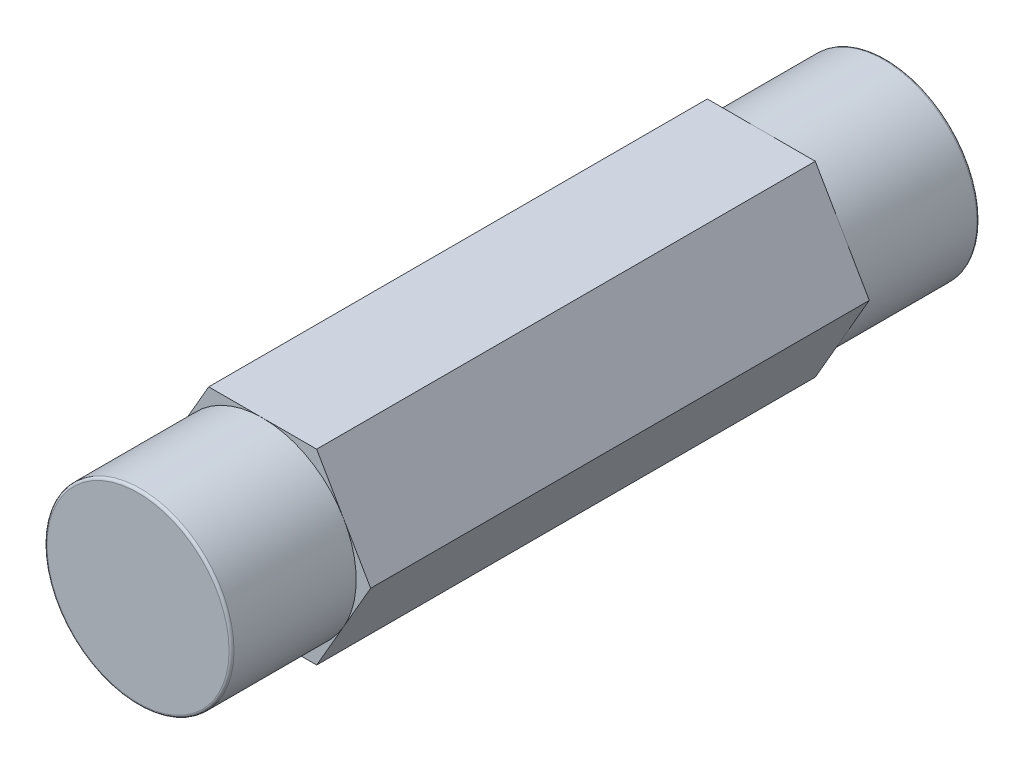
ISO-10303-21;
HEADER;
FILE_DESCRIPTION(('STEP AP214'),'2;1');
FILE_NAME('part.step','',(''),(''),'','','');
FILE_SCHEMA(('AUTOMOTIVE_DESIGN { 1 0 10303 214 1 1 1 1 }'));
ENDSEC;
DATA;
#1=APPLICATION_CONTEXT('core data for automotive mechanical design processes');
#2=APPLICATION_PROTOCOL_DEFINITION('international standard','automotive_design',2000,#1);
#3=PRODUCT_CONTEXT('',#1,'mechanical');
#4=PRODUCT('Part','Part','',(#3));
#5=PRODUCT_RELATED_PRODUCT_CATEGORY('part','',(#4));
#6=PRODUCT_DEFINITION_FORMATION('','',#4);
#7=PRODUCT_DEFINITION_CONTEXT('part definition',#1,'design');
#8=PRODUCT_DEFINITION('design','',#6,#7);
#9=PRODUCT_DEFINITION_SHAPE('','',#8);
#10=(LENGTH_UNIT() NAMED_UNIT(*) SI_UNIT(.MILLI.,.METRE.));
#11=(NAMED_UNIT(*) PLANE_ANGLE_UNIT() SI_UNIT($,.RADIAN.));
#12=(NAMED_UNIT(*) SI_UNIT($,.STERADIAN.) SOLID_ANGLE_UNIT());
#13=UNCERTAINTY_MEASURE_WITH_UNIT(LENGTH_MEASURE(1.E-05),#10,'distance_accuracy_value','');
#14=(GEOMETRIC_REPRESENTATION_CONTEXT(3) GLOBAL_UNCERTAINTY_ASSIGNED_CONTEXT((#13)) GLOBAL_UNIT_ASSIGNED_CONTEXT((#10,
#11,#12)) REPRESENTATION_CONTEXT('',''));
#15=CARTESIAN_POINT('',(0.,0.,0.));
#16=DIRECTION('',(0.,0.,1.));
#17=DIRECTION('',(1.,0.,0.));
#18=AXIS2_PLACEMENT_3D('',#15,#16,#17);
#19=CARTESIAN_POINT('',(5.49926131403119,0.,38.1));
#20=DIRECTION('',(0.,0.,1.));
#21=DIRECTION('',(1.,0.,0.));
#22=AXIS2_PLACEMENT_3D('',#19,#20,#21);
#23=PLANE('',#22);
#24=CARTESIAN_POINT('',(0.,0.,38.1));
#25=DIRECTION('',(0.,0.,-1.));
#26=DIRECTION('',(-1.,0.,0.));
#27=AXIS2_PLACEMENT_3D('',#24,#25,#26);
#28=CIRCLE('',#27,4.6355);
#29=CARTESIAN_POINT('',(-4.6355,0.,38.1));
#30=VERTEX_POINT('',#29);
#31=CARTESIAN_POINT('',(4.6355,0.,38.1));
#32=VERTEX_POINT('',#31);
#33=EDGE_CURVE('E239',#30,#32,#28,.T.);
#34=ORIENTED_EDGE('',*,*,#33,.F.);
#35=CARTESIAN_POINT('',(0.,0.,38.1));
#36=DIRECTION('',(0.,0.,-1.));
#37=DIRECTION('',(1.,0.,0.));
#38=AXIS2_PLACEMENT_3D('',#35,#36,#37);
#39=CIRCLE('',#38,4.6355);
#40=EDGE_CURVE('E242',#32,#30,#39,.T.);
#41=ORIENTED_EDGE('',*,*,#40,.F.);
#42=EDGE_LOOP('',(#34,#41));
#43=FACE_BOUND('',#42,.T.);
#44=ADVANCED_FACE('F17',(#43),#23,.T.);
#45=CARTESIAN_POINT('',(5.49926131403119,0.,0.));
#46=DIRECTION('',(0.,0.,1.));
#47=DIRECTION('',(1.,0.,0.));
#48=AXIS2_PLACEMENT_3D('',#45,#46,#47);
#49=PLANE('',#48);
#50=CARTESIAN_POINT('',(0.,0.,0.));
#51=DIRECTION('',(0.,0.,1.));
#52=DIRECTION('',(1.,0.,0.));
#53=AXIS2_PLACEMENT_3D('',#50,#51,#52);
#54=CIRCLE('',#53,4.6355);
#55=CARTESIAN_POINT('',(4.6355,0.,0.));
#56=VERTEX_POINT('',#55);
#57=CARTESIAN_POINT('',(-4.6355,0.,0.));
#58=VERTEX_POINT('',#57);
#59=EDGE_CURVE('E199',#56,#58,#54,.T.);
#60=ORIENTED_EDGE('',*,*,#59,.F.);
#61=CARTESIAN_POINT('',(0.,0.,0.));
#62=DIRECTION('',(0.,0.,1.));
#63=DIRECTION('',(-1.,0.,0.));
#64=AXIS2_PLACEMENT_3D('',#61,#62,#63);
#65=CIRCLE('',#64,4.6355);
#66=EDGE_CURVE('E296',#58,#56,#65,.T.);
#67=ORIENTED_EDGE('',*,*,#66,.F.);
#68=EDGE_LOOP('',(#60,#67));
#69=FACE_BOUND('',#68,.T.);
#70=ADVANCED_FACE('F307',(#69),#49,.F.);
#71=CARTESIAN_POINT('',(0.,0.,31.75));
#72=DIRECTION('',(0.,0.,1.));
#73=DIRECTION('',(1.,0.,0.));
#74=AXIS2_PLACEMENT_3D('',#71,#72,#73);
#75=PLANE('',#74);
#76=CARTESIAN_POINT('',(0.,0.,31.75));
#77=DIRECTION('',(0.,0.,1.));
#78=DIRECTION('',(1.,0.,0.));
#79=AXIS2_PLACEMENT_3D('',#76,#77,#78);
#80=CIRCLE('',#79,4.7625);
#81=CARTESIAN_POINT('',(-4.1244459855234,2.38125,31.75));
#82=VERTEX_POINT('',#81);
#83=CARTESIAN_POINT('',(-4.1244459855234,-2.38124999999999,31.75));
#84=VERTEX_POINT('',#83);
#85=EDGE_CURVE('E127',#82,#84,#80,.T.);
#86=ORIENTED_EDGE('',*,*,#85,.F.);
#87=DIRECTION('',(0.5,0.866025403784439,0.));
#88=VECTOR('',#87,1.);
#89=CARTESIAN_POINT('',(-2.7496306570156,4.76250000000001,31.75));
#90=LINE('',#89,#88);
#91=CARTESIAN_POINT('',(-5.4992613140312,0.,31.75));
#92=VERTEX_POINT('',#91);
#93=EDGE_CURVE('E294',#82,#92,#90,.F.);
#94=ORIENTED_EDGE('',*,*,#93,.T.);
#95=DIRECTION('',(-0.5,0.866025403784439,0.));
#96=VECTOR('',#95,1.);
#97=CARTESIAN_POINT('',(-5.4992613140312,0.,31.75));
#98=LINE('',#97,#96);
#99=EDGE_CURVE('E189',#92,#84,#98,.F.);
#100=ORIENTED_EDGE('',*,*,#99,.T.);
#101=EDGE_LOOP('',(#86,#94,#100));
#102=FACE_BOUND('',#101,.T.);
#103=ADVANCED_FACE('F272',(#102),#75,.T.);
#104=CARTESIAN_POINT('',(0.,0.,37.973));
#105=DIRECTION('',(0.,0.,1.));
#106=DIRECTION('',(1.,0.,0.));
#107=AXIS2_PLACEMENT_3D('',#104,#105,#106);
#108=TOROIDAL_SURFACE('',#107,4.6355,0.127);
#109=CARTESIAN_POINT('',(0.,0.,37.973));
#110=DIRECTION('',(0.,0.,1.));
#111=DIRECTION('',(1.,0.,0.));
#112=AXIS2_PLACEMENT_3D('',#109,#110,#111);
#113=CIRCLE('',#112,4.7625);
#114=CARTESIAN_POINT('',(4.7625,0.,37.973));
#115=VERTEX_POINT('',#114);
#116=EDGE_CURVE('E141',#115,#115,#113,.F.);
#117=ORIENTED_EDGE('',*,*,#116,.F.);
#118=EDGE_LOOP('',(#117));
#119=FACE_BOUND('',#118,.T.);
#120=ORIENTED_EDGE('',*,*,#40,.T.);
#121=ORIENTED_EDGE('',*,*,#33,.T.);
#122=EDGE_LOOP('',(#120,#121));
#123=FACE_BOUND('',#122,.T.);
#124=ADVANCED_FACE('F241',(#119,#123),#108,.T.);
#125=CARTESIAN_POINT('',(0.,0.,31.75));
#126=DIRECTION('',(0.,0.,1.));
#127=DIRECTION('',(1.,0.,0.));
#128=AXIS2_PLACEMENT_3D('',#125,#126,#127);
#129=PLANE('',#128);
#130=DIRECTION('',(0.5,0.866025403784439,0.));
#131=VECTOR('',#130,1.);
#132=CARTESIAN_POINT('',(-2.7496306570156,4.76250000000001,31.75));
#133=LINE('',#132,#131);
#134=CARTESIAN_POINT('',(-2.7496306570156,4.76250000000001,31.75));
#135=VERTEX_POINT('',#134);
#136=EDGE_CURVE('E124',#135,#82,#133,.F.);
#137=ORIENTED_EDGE('',*,*,#136,.T.);
#138=CARTESIAN_POINT('',(0.,0.,31.75));
#139=DIRECTION('',(0.,0.,1.));
#140=DIRECTION('',(1.,0.,0.));
#141=AXIS2_PLACEMENT_3D('',#138,#139,#140);
#142=CIRCLE('',#141,4.7625);
#143=CARTESIAN_POINT('',(0.,4.76250000000001,31.75));
#144=VERTEX_POINT('',#143);
#145=EDGE_CURVE('E119',#144,#82,#142,.T.);
#146=ORIENTED_EDGE('',*,*,#145,.F.);
#147=DIRECTION('',(1.,0.,0.));
#148=VECTOR('',#147,1.);
#149=CARTESIAN_POINT('',(2.74963065701559,4.76250000000001,31.75));
#150=LINE('',#149,#148);
#151=EDGE_CURVE('E123',#144,#135,#150,.F.);
#152=ORIENTED_EDGE('',*,*,#151,.T.);
#153=EDGE_LOOP('',(#137,#146,#152));
#154=FACE_BOUND('',#153,.T.);
#155=ADVANCED_FACE('F121',(#154),#129,.T.);
#156=CARTESIAN_POINT('',(-2.7496306570156,4.76250000000001,38.1));
#157=DIRECTION('',(0.866025403784439,-0.5,0.));
#158=DIRECTION('',(0.5,0.866025403784439,0.));
#159=AXIS2_PLACEMENT_3D('',#156,#157,#158);
#160=PLANE('',#159);
#161=DIRECTION('',(0.,0.,1.));
#162=VECTOR('',#161,1.);
#163=CARTESIAN_POINT('',(-5.4992613140312,0.,38.1));
#164=LINE('',#163,#162);
#165=CARTESIAN_POINT('',(-5.4992613140312,0.,6.34999999999999));
#166=VERTEX_POINT('',#165);
#167=EDGE_CURVE('E283',#166,#92,#164,.T.);
#168=ORIENTED_EDGE('',*,*,#167,.T.);
#169=ORIENTED_EDGE('',*,*,#93,.F.);
#170=ORIENTED_EDGE('',*,*,#136,.F.);
#171=DIRECTION('',(0.,0.,-1.));
#172=VECTOR('',#171,1.);
#173=CARTESIAN_POINT('',(-2.7496306570156,4.76250000000001,38.1));
#174=LINE('',#173,#172);
#175=CARTESIAN_POINT('',(-2.7496306570156,4.76250000000001,6.35));
#176=VERTEX_POINT('',#175);
#177=EDGE_CURVE('E150',#135,#176,#174,.T.);
#178=ORIENTED_EDGE('',*,*,#177,.T.);
#179=DIRECTION('',(0.499999999999997,0.866025403784441,0.));
#180=VECTOR('',#179,1.);
#181=CARTESIAN_POINT('',(-4.12444598552339,2.38125,6.35));
#182=LINE('',#181,#180);
#183=CARTESIAN_POINT('',(-4.12444598552339,2.38125,6.35));
#184=VERTEX_POINT('',#183);
#185=EDGE_CURVE('E192',#184,#176,#182,.T.);
#186=ORIENTED_EDGE('',*,*,#185,.F.);
#187=DIRECTION('',(0.500000000000003,0.866025403784437,0.));
#188=VECTOR('',#187,1.);
#189=CARTESIAN_POINT('',(-5.4992613140312,0.,6.35));
#190=LINE('',#189,#188);
#191=EDGE_CURVE('E195',#166,#184,#190,.T.);
#192=ORIENTED_EDGE('',*,*,#191,.F.);
#193=EDGE_LOOP('',(#168,#169,#170,#178,#186,#192));
#194=FACE_BOUND('',#193,.T.);
#195=ADVANCED_FACE('F218',(#194),#160,.F.);
#196=CARTESIAN_POINT('',(0.,0.,0.127));
#197=DIRECTION('',(0.,0.,1.));
#198=DIRECTION('',(1.,0.,0.));
#199=AXIS2_PLACEMENT_3D('',#196,#197,#198);
#200=TOROIDAL_SURFACE('',#199,4.6355,0.127);
#201=CARTESIAN_POINT('',(0.,0.,0.127));
#202=DIRECTION('',(0.,0.,-1.));
#203=DIRECTION('',(-1.,0.,0.));
#204=AXIS2_PLACEMENT_3D('',#201,#202,#203);
#205=CIRCLE('',#204,4.7625);
#206=CARTESIAN_POINT('',(-4.7625,0.,0.127));
#207=VERTEX_POINT('',#206);
#208=EDGE_CURVE('E202',#207,#207,#205,.F.);
#209=ORIENTED_EDGE('',*,*,#208,.F.);
#210=EDGE_LOOP('',(#209));
#211=FACE_BOUND('',#210,.T.);
#212=ORIENTED_EDGE('',*,*,#59,.T.);
#213=ORIENTED_EDGE('',*,*,#66,.T.);
#214=EDGE_LOOP('',(#212,#213));
#215=FACE_BOUND('',#214,.T.);
#216=ADVANCED_FACE('F212',(#211,#215),#200,.T.);
#217=CARTESIAN_POINT('',(0.,0.,6.35));
#218=DIRECTION('',(0.,0.,-1.));
#219=DIRECTION('',(-1.,0.,0.));
#220=AXIS2_PLACEMENT_3D('',#217,#218,#219);
#221=PLANE('',#220);
#222=CARTESIAN_POINT('',(0.,0.,6.35));
#223=DIRECTION('',(0.,0.,-1.));
#224=DIRECTION('',(-1.,0.,0.));
#225=AXIS2_PLACEMENT_3D('',#222,#223,#224);
#226=CIRCLE('',#225,4.7625);
#227=CARTESIAN_POINT('',(-4.1244459855234,-2.38125,6.34999999999999));
#228=VERTEX_POINT('',#227);
#229=EDGE_CURVE('E205',#228,#184,#226,.T.);
#230=ORIENTED_EDGE('',*,*,#229,.F.);
#231=DIRECTION('',(-0.5,0.866025403784439,0.));
#232=VECTOR('',#231,1.);
#233=CARTESIAN_POINT('',(-5.4992613140312,0.,6.34999999999999));
#234=LINE('',#233,#232);
#235=EDGE_CURVE('E194',#228,#166,#234,.T.);
#236=ORIENTED_EDGE('',*,*,#235,.T.);
#237=ORIENTED_EDGE('',*,*,#191,.T.);
#238=EDGE_LOOP('',(#230,#236,#237));
#239=FACE_BOUND('',#238,.T.);
#240=ADVANCED_FACE('F217',(#239),#221,.T.);
#241=CARTESIAN_POINT('',(0.,0.,6.35));
#242=DIRECTION('',(0.,0.,-1.));
#243=DIRECTION('',(-1.,0.,0.));
#244=AXIS2_PLACEMENT_3D('',#241,#242,#243);
#245=PLANE('',#244);
#246=CARTESIAN_POINT('',(0.,0.,6.35));
#247=DIRECTION('',(0.,0.,-1.));
#248=DIRECTION('',(-1.,0.,0.));
#249=AXIS2_PLACEMENT_3D('',#246,#247,#248);
#250=CIRCLE('',#249,4.7625);
#251=CARTESIAN_POINT('',(0.,4.76250000000001,6.35));
#252=VERTEX_POINT('',#251);
#253=EDGE_CURVE('E395',#184,#252,#250,.T.);
#254=ORIENTED_EDGE('',*,*,#253,.F.);
#255=ORIENTED_EDGE('',*,*,#185,.T.);
#256=DIRECTION('',(1.,0.,0.));
#257=VECTOR('',#256,1.);
#258=CARTESIAN_POINT('',(2.74963065701559,4.76250000000001,6.35));
#259=LINE('',#258,#257);
#260=EDGE_CURVE('E209',#176,#252,#259,.T.);
#261=ORIENTED_EDGE('',*,*,#260,.T.);
#262=EDGE_LOOP('',(#254,#255,#261));
#263=FACE_BOUND('',#262,.T.);
#264=ADVANCED_FACE('F385',(#263),#245,.T.);
#265=CARTESIAN_POINT('',(0.,0.,6.35));
#266=DIRECTION('',(0.,0.,-1.));
#267=DIRECTION('',(-1.,0.,0.));
#268=AXIS2_PLACEMENT_3D('',#265,#266,#267);
#269=PLANE('',#268);
#270=CARTESIAN_POINT('',(0.,0.,6.35));
#271=DIRECTION('',(0.,0.,-1.));
#272=DIRECTION('',(-1.,0.,0.));
#273=AXIS2_PLACEMENT_3D('',#270,#271,#272);
#274=CIRCLE('',#273,4.7625);
#275=CARTESIAN_POINT('',(0.,-4.76250000000001,6.35));
#276=VERTEX_POINT('',#275);
#277=EDGE_CURVE('E206',#276,#228,#274,.T.);
#278=ORIENTED_EDGE('',*,*,#277,.F.);
#279=DIRECTION('',(1.,0.,0.));
#280=VECTOR('',#279,1.);
#281=CARTESIAN_POINT('',(-2.7496306570156,-4.76250000000001,6.35));
#282=LINE('',#281,#280);
#283=CARTESIAN_POINT('',(-2.7496306570156,-4.76250000000001,6.35));
#284=VERTEX_POINT('',#283);
#285=EDGE_CURVE('E173',#276,#284,#282,.F.);
#286=ORIENTED_EDGE('',*,*,#285,.T.);
#287=DIRECTION('',(-0.5,0.866025403784439,0.));
#288=VECTOR('',#287,1.);
#289=CARTESIAN_POINT('',(-5.4992613140312,0.,6.34999999999999));
#290=LINE('',#289,#288);
#291=EDGE_CURVE('E180',#284,#228,#290,.T.);
#292=ORIENTED_EDGE('',*,*,#291,.T.);
#293=EDGE_LOOP('',(#278,#286,#292));
#294=FACE_BOUND('',#293,.T.);
#295=ADVANCED_FACE('F382',(#294),#269,.T.);
#296=CARTESIAN_POINT('',(-5.4992613140312,0.,38.1));
#297=DIRECTION('',(0.866025403784439,0.5,0.));
#298=DIRECTION('',(-0.5,0.866025403784439,0.));
#299=AXIS2_PLACEMENT_3D('',#296,#297,#298);
#300=PLANE('',#299);
#301=DIRECTION('',(0.,0.,1.));
#302=VECTOR('',#301,1.);
#303=CARTESIAN_POINT('',(-2.7496306570156,-4.76250000000001,38.1));
#304=LINE('',#303,#302);
#305=CARTESIAN_POINT('',(-2.7496306570156,-4.76250000000001,31.75));
#306=VERTEX_POINT('',#305);
#307=EDGE_CURVE('E170',#284,#306,#304,.T.);
#308=ORIENTED_EDGE('',*,*,#307,.T.);
#309=DIRECTION('',(0.499999999999997,-0.866025403784441,0.));
#310=VECTOR('',#309,1.);
#311=CARTESIAN_POINT('',(-4.12444598552339,-2.38125,31.75));
#312=LINE('',#311,#310);
#313=EDGE_CURVE('E128',#84,#306,#312,.T.);
#314=ORIENTED_EDGE('',*,*,#313,.F.);
#315=ORIENTED_EDGE('',*,*,#99,.F.);
#316=ORIENTED_EDGE('',*,*,#167,.F.);
#317=ORIENTED_EDGE('',*,*,#235,.F.);
#318=ORIENTED_EDGE('',*,*,#291,.F.);
#319=EDGE_LOOP('',(#308,#314,#315,#316,#317,#318));
#320=FACE_BOUND('',#319,.T.);
#321=ADVANCED_FACE('F378',(#320),#300,.F.);
#322=CARTESIAN_POINT('',(0.,0.,31.75));
#323=DIRECTION('',(0.,0.,1.));
#324=DIRECTION('',(1.,0.,0.));
#325=AXIS2_PLACEMENT_3D('',#322,#323,#324);
#326=PLANE('',#325);
#327=DIRECTION('',(1.,0.,0.));
#328=VECTOR('',#327,1.);
#329=CARTESIAN_POINT('',(-2.7496306570156,-4.76250000000001,31.75));
#330=LINE('',#329,#328);
#331=CARTESIAN_POINT('',(0.,-4.76250000000001,31.75));
#332=VERTEX_POINT('',#331);
#333=EDGE_CURVE('E166',#306,#332,#330,.T.);
#334=ORIENTED_EDGE('',*,*,#333,.T.);
#335=CARTESIAN_POINT('',(0.,0.,31.75));
#336=DIRECTION('',(0.,0.,1.));
#337=DIRECTION('',(1.,0.,0.));
#338=AXIS2_PLACEMENT_3D('',#335,#336,#337);
#339=CIRCLE('',#338,4.7625);
#340=EDGE_CURVE('E281',#84,#332,#339,.T.);
#341=ORIENTED_EDGE('',*,*,#340,.F.);
#342=ORIENTED_EDGE('',*,*,#313,.T.);
#343=EDGE_LOOP('',(#334,#341,#342));
#344=FACE_BOUND('',#343,.T.);
#345=ADVANCED_FACE('F375',(#344),#326,.T.);
#346=CARTESIAN_POINT('',(0.,0.,31.75));
#347=DIRECTION('',(0.,0.,1.));
#348=DIRECTION('',(1.,0.,0.));
#349=AXIS2_PLACEMENT_3D('',#346,#347,#348);
#350=CYLINDRICAL_SURFACE('',#349,4.7625);
#351=ORIENTED_EDGE('',*,*,#145,.T.);
#352=ORIENTED_EDGE('',*,*,#85,.T.);
#353=ORIENTED_EDGE('',*,*,#340,.T.);
#354=CARTESIAN_POINT('',(0.,0.,31.75));
#355=DIRECTION('',(0.,0.,1.));
#356=DIRECTION('',(1.,0.,0.));
#357=AXIS2_PLACEMENT_3D('',#354,#355,#356);
#358=CIRCLE('',#357,4.7625);
#359=CARTESIAN_POINT('',(4.12444598552339,-2.38125,31.75));
#360=VERTEX_POINT('',#359);
#361=EDGE_CURVE('E426',#360,#332,#358,.F.);
#362=ORIENTED_EDGE('',*,*,#361,.F.);
#363=CARTESIAN_POINT('',(0.,0.,31.75));
#364=DIRECTION('',(0.,0.,1.));
#365=DIRECTION('',(1.,0.,0.));
#366=AXIS2_PLACEMENT_3D('',#363,#364,#365);
#367=CIRCLE('',#366,4.7625);
#368=CARTESIAN_POINT('',(4.12444598552339,2.38125,31.75));
#369=VERTEX_POINT('',#368);
#370=EDGE_CURVE('E135',#369,#360,#367,.F.);
#371=ORIENTED_EDGE('',*,*,#370,.F.);
#372=CARTESIAN_POINT('',(0.,0.,31.75));
#373=DIRECTION('',(0.,0.,1.));
#374=DIRECTION('',(1.,0.,0.));
#375=AXIS2_PLACEMENT_3D('',#372,#373,#374);
#376=CIRCLE('',#375,4.7625);
#377=EDGE_CURVE('E131',#144,#369,#376,.F.);
#378=ORIENTED_EDGE('',*,*,#377,.F.);
#379=EDGE_LOOP('',(#351,#352,#353,#362,#371,#378));
#380=FACE_BOUND('',#379,.T.);
#381=ORIENTED_EDGE('',*,*,#116,.T.);
#382=EDGE_LOOP('',(#381));
#383=FACE_BOUND('',#382,.T.);
#384=ADVANCED_FACE('F132',(#380,#383),#350,.T.);
#385=CARTESIAN_POINT('',(0.,0.,31.75));
#386=DIRECTION('',(0.,0.,1.));
#387=DIRECTION('',(1.,0.,0.));
#388=AXIS2_PLACEMENT_3D('',#385,#386,#387);
#389=PLANE('',#388);
#390=DIRECTION('',(1.,0.,0.));
#391=VECTOR('',#390,1.);
#392=CARTESIAN_POINT('',(2.74963065701559,4.76250000000001,31.75));
#393=LINE('',#392,#391);
#394=CARTESIAN_POINT('',(2.74963065701559,4.76250000000001,31.75));
#395=VERTEX_POINT('',#394);
#396=EDGE_CURVE('E140',#395,#144,#393,.F.);
#397=ORIENTED_EDGE('',*,*,#396,.T.);
#398=ORIENTED_EDGE('',*,*,#377,.T.);
#399=DIRECTION('',(0.500000000000001,-0.866025403784438,0.));
#400=VECTOR('',#399,1.);
#401=CARTESIAN_POINT('',(5.49926131403119,0.,31.75));
#402=LINE('',#401,#400);
#403=EDGE_CURVE('E153',#369,#395,#402,.F.);
#404=ORIENTED_EDGE('',*,*,#403,.T.);
#405=EDGE_LOOP('',(#397,#398,#404));
#406=FACE_BOUND('',#405,.T.);
#407=ADVANCED_FACE('F152',(#406),#389,.T.);
#408=CARTESIAN_POINT('',(2.74963065701559,4.76250000000001,38.1));
#409=DIRECTION('',(0.,-1.,0.));
#410=DIRECTION('',(0.,0.,-1.));
#411=AXIS2_PLACEMENT_3D('',#408,#409,#410);
#412=PLANE('',#411);
#413=ORIENTED_EDGE('',*,*,#177,.F.);
#414=ORIENTED_EDGE('',*,*,#151,.F.);
#415=ORIENTED_EDGE('',*,*,#396,.F.);
#416=DIRECTION('',(0.,0.,1.));
#417=VECTOR('',#416,1.);
#418=CARTESIAN_POINT('',(2.74963065701559,4.76250000000001,38.1));
#419=LINE('',#418,#417);
#420=CARTESIAN_POINT('',(2.74963065701559,4.76250000000001,6.35));
#421=VERTEX_POINT('',#420);
#422=EDGE_CURVE('E162',#395,#421,#419,.F.);
#423=ORIENTED_EDGE('',*,*,#422,.T.);
#424=DIRECTION('',(-1.,0.,0.));
#425=VECTOR('',#424,1.);
#426=CARTESIAN_POINT('',(0.,4.7625,6.35));
#427=LINE('',#426,#425);
#428=EDGE_CURVE('E407',#252,#421,#427,.F.);
#429=ORIENTED_EDGE('',*,*,#428,.F.);
#430=ORIENTED_EDGE('',*,*,#260,.F.);
#431=EDGE_LOOP('',(#413,#414,#415,#423,#429,#430));
#432=FACE_BOUND('',#431,.T.);
#433=ADVANCED_FACE('F145',(#432),#412,.F.);
#434=CARTESIAN_POINT('',(0.,0.,6.35));
#435=DIRECTION('',(0.,0.,-1.));
#436=DIRECTION('',(-1.,0.,0.));
#437=AXIS2_PLACEMENT_3D('',#434,#435,#436);
#438=PLANE('',#437);
#439=DIRECTION('',(0.500000000000001,-0.866025403784438,0.));
#440=VECTOR('',#439,1.);
#441=CARTESIAN_POINT('',(5.49926131403119,0.,6.35));
#442=LINE('',#441,#440);
#443=CARTESIAN_POINT('',(4.12444598552339,2.38125,6.35));
#444=VERTEX_POINT('',#443);
#445=EDGE_CURVE('E444',#421,#444,#442,.T.);
#446=ORIENTED_EDGE('',*,*,#445,.T.);
#447=CARTESIAN_POINT('',(0.,0.,6.35));
#448=DIRECTION('',(0.,0.,-1.));
#449=DIRECTION('',(-1.,0.,0.));
#450=AXIS2_PLACEMENT_3D('',#447,#448,#449);
#451=CIRCLE('',#450,4.7625);
#452=EDGE_CURVE('E400',#252,#444,#451,.T.);
#453=ORIENTED_EDGE('',*,*,#452,.F.);
#454=ORIENTED_EDGE('',*,*,#428,.T.);
#455=EDGE_LOOP('',(#446,#453,#454));
#456=FACE_BOUND('',#455,.T.);
#457=ADVANCED_FACE('F364',(#456),#438,.T.);
#458=CARTESIAN_POINT('',(0.,0.,6.35));
#459=DIRECTION('',(0.,0.,-1.));
#460=DIRECTION('',(-1.,0.,0.));
#461=AXIS2_PLACEMENT_3D('',#458,#459,#460);
#462=CYLINDRICAL_SURFACE('',#461,4.7625);
#463=ORIENTED_EDGE('',*,*,#208,.T.);
#464=EDGE_LOOP('',(#463));
#465=FACE_BOUND('',#464,.T.);
#466=ORIENTED_EDGE('',*,*,#253,.T.);
#467=ORIENTED_EDGE('',*,*,#452,.T.);
#468=CARTESIAN_POINT('',(0.,0.,6.35));
#469=DIRECTION('',(0.,0.,-1.));
#470=DIRECTION('',(-1.,0.,0.));
#471=AXIS2_PLACEMENT_3D('',#468,#469,#470);
#472=CIRCLE('',#471,4.7625);
#473=CARTESIAN_POINT('',(4.12444598552339,-2.38125,6.35));
#474=VERTEX_POINT('',#473);
#475=EDGE_CURVE('E261',#474,#444,#472,.F.);
#476=ORIENTED_EDGE('',*,*,#475,.F.);
#477=CARTESIAN_POINT('',(0.,0.,6.35));
#478=DIRECTION('',(0.,0.,-1.));
#479=DIRECTION('',(-1.,0.,0.));
#480=AXIS2_PLACEMENT_3D('',#477,#478,#479);
#481=CIRCLE('',#480,4.7625);
#482=EDGE_CURVE('E176',#276,#474,#481,.F.);
#483=ORIENTED_EDGE('',*,*,#482,.F.);
#484=ORIENTED_EDGE('',*,*,#277,.T.);
#485=ORIENTED_EDGE('',*,*,#229,.T.);
#486=EDGE_LOOP('',(#466,#467,#476,#483,#484,#485));
#487=FACE_BOUND('',#486,.T.);
#488=ADVANCED_FACE('F360',(#465,#487),#462,.T.);
#489=CARTESIAN_POINT('',(0.,0.,6.35));
#490=DIRECTION('',(0.,0.,-1.));
#491=DIRECTION('',(-1.,0.,0.));
#492=AXIS2_PLACEMENT_3D('',#489,#490,#491);
#493=PLANE('',#492);
#494=DIRECTION('',(1.,0.,0.));
#495=VECTOR('',#494,1.);
#496=CARTESIAN_POINT('',(-2.7496306570156,-4.76250000000001,6.35));
#497=LINE('',#496,#495);
#498=CARTESIAN_POINT('',(2.74963065701559,-4.76250000000001,6.35));
#499=VERTEX_POINT('',#498);
#500=EDGE_CURVE('E169',#499,#276,#497,.F.);
#501=ORIENTED_EDGE('',*,*,#500,.T.);
#502=ORIENTED_EDGE('',*,*,#482,.T.);
#503=DIRECTION('',(-0.5,-0.866025403784439,0.));
#504=VECTOR('',#503,1.);
#505=CARTESIAN_POINT('',(2.74963065701559,-4.76250000000001,6.35));
#506=LINE('',#505,#504);
#507=EDGE_CURVE('E437',#474,#499,#506,.T.);
#508=ORIENTED_EDGE('',*,*,#507,.T.);
#509=EDGE_LOOP('',(#501,#502,#508));
#510=FACE_BOUND('',#509,.T.);
#511=ADVANCED_FACE('F356',(#510),#493,.T.);
#512=CARTESIAN_POINT('',(-2.7496306570156,-4.76250000000001,38.1));
#513=DIRECTION('',(0.,1.,0.));
#514=DIRECTION('',(0.,0.,1.));
#515=AXIS2_PLACEMENT_3D('',#512,#513,#514);
#516=PLANE('',#515);
#517=DIRECTION('',(0.,0.,1.));
#518=VECTOR('',#517,1.);
#519=CARTESIAN_POINT('',(2.74963065701559,-4.76250000000001,38.1));
#520=LINE('',#519,#518);
#521=CARTESIAN_POINT('',(2.74963065701559,-4.76250000000001,31.75));
#522=VERTEX_POINT('',#521);
#523=EDGE_CURVE('E423',#499,#522,#520,.T.);
#524=ORIENTED_EDGE('',*,*,#523,.T.);
#525=DIRECTION('',(1.,0.,0.));
#526=VECTOR('',#525,1.);
#527=CARTESIAN_POINT('',(0.,-4.7625,31.75));
#528=LINE('',#527,#526);
#529=EDGE_CURVE('E421',#332,#522,#528,.T.);
#530=ORIENTED_EDGE('',*,*,#529,.F.);
#531=ORIENTED_EDGE('',*,*,#333,.F.);
#532=ORIENTED_EDGE('',*,*,#307,.F.);
#533=ORIENTED_EDGE('',*,*,#285,.F.);
#534=ORIENTED_EDGE('',*,*,#500,.F.);
#535=EDGE_LOOP('',(#524,#530,#531,#532,#533,#534));
#536=FACE_BOUND('',#535,.T.);
#537=ADVANCED_FACE('F352',(#536),#516,.F.);
#538=CARTESIAN_POINT('',(0.,0.,31.75));
#539=DIRECTION('',(0.,0.,1.));
#540=DIRECTION('',(1.,0.,0.));
#541=AXIS2_PLACEMENT_3D('',#538,#539,#540);
#542=PLANE('',#541);
#543=ORIENTED_EDGE('',*,*,#361,.T.);
#544=ORIENTED_EDGE('',*,*,#529,.T.);
#545=DIRECTION('',(-0.5,-0.866025403784439,0.));
#546=VECTOR('',#545,1.);
#547=CARTESIAN_POINT('',(2.74963065701559,-4.76250000000001,31.75));
#548=LINE('',#547,#546);
#549=EDGE_CURVE('E436',#522,#360,#548,.F.);
#550=ORIENTED_EDGE('',*,*,#549,.T.);
#551=EDGE_LOOP('',(#543,#544,#550));
#552=FACE_BOUND('',#551,.T.);
#553=ADVANCED_FACE('F348',(#552),#542,.T.);
#554=CARTESIAN_POINT('',(0.,0.,31.75));
#555=DIRECTION('',(0.,0.,1.));
#556=DIRECTION('',(1.,0.,0.));
#557=AXIS2_PLACEMENT_3D('',#554,#555,#556);
#558=PLANE('',#557);
#559=DIRECTION('',(0.500000000000001,-0.866025403784438,0.));
#560=VECTOR('',#559,1.);
#561=CARTESIAN_POINT('',(5.49926131403119,0.,31.75));
#562=LINE('',#561,#560);
#563=CARTESIAN_POINT('',(5.49926131403119,0.,31.75));
#564=VERTEX_POINT('',#563);
#565=EDGE_CURVE('E163',#564,#369,#562,.F.);
#566=ORIENTED_EDGE('',*,*,#565,.T.);
#567=ORIENTED_EDGE('',*,*,#370,.T.);
#568=DIRECTION('',(-0.5,-0.866025403784439,0.));
#569=VECTOR('',#568,1.);
#570=CARTESIAN_POINT('',(2.74963065701559,-4.76250000000001,31.75));
#571=LINE('',#570,#569);
#572=EDGE_CURVE('E468',#360,#564,#571,.F.);
#573=ORIENTED_EDGE('',*,*,#572,.T.);
#574=EDGE_LOOP('',(#566,#567,#573));
#575=FACE_BOUND('',#574,.T.);
#576=ADVANCED_FACE('F344',(#575),#558,.T.);
#577=CARTESIAN_POINT('',(5.49926131403119,0.,38.1));
#578=DIRECTION('',(-0.866025403784438,-0.500000000000001,0.));
#579=DIRECTION('',(0.500000000000001,-0.866025403784438,0.));
#580=AXIS2_PLACEMENT_3D('',#577,#578,#579);
#581=PLANE('',#580);
#582=ORIENTED_EDGE('',*,*,#422,.F.);
#583=ORIENTED_EDGE('',*,*,#403,.F.);
#584=ORIENTED_EDGE('',*,*,#565,.F.);
#585=DIRECTION('',(0.,0.,1.));
#586=VECTOR('',#585,1.);
#587=CARTESIAN_POINT('',(5.49926131403119,0.,38.1));
#588=LINE('',#587,#586);
#589=CARTESIAN_POINT('',(5.49926131403119,0.,6.35));
#590=VERTEX_POINT('',#589);
#591=EDGE_CURVE('E29',#564,#590,#588,.F.);
#592=ORIENTED_EDGE('',*,*,#591,.T.);
#593=DIRECTION('',(0.500000000000001,-0.866025403784438,0.));
#594=VECTOR('',#593,1.);
#595=CARTESIAN_POINT('',(4.12444598552339,2.38125,6.35));
#596=LINE('',#595,#594);
#597=EDGE_CURVE('E37',#444,#590,#596,.T.);
#598=ORIENTED_EDGE('',*,*,#597,.F.);
#599=ORIENTED_EDGE('',*,*,#445,.F.);
#600=EDGE_LOOP('',(#582,#583,#584,#592,#598,#599));
#601=FACE_BOUND('',#600,.T.);
#602=ADVANCED_FACE('F338',(#601),#581,.F.);
#603=CARTESIAN_POINT('',(0.,0.,6.35));
#604=DIRECTION('',(0.,0.,-1.));
#605=DIRECTION('',(-1.,0.,0.));
#606=AXIS2_PLACEMENT_3D('',#603,#604,#605);
#607=PLANE('',#606);
#608=DIRECTION('',(-0.5,-0.866025403784439,0.));
#609=VECTOR('',#608,1.);
#610=CARTESIAN_POINT('',(2.74963065701559,-4.76250000000001,6.35));
#611=LINE('',#610,#609);
#612=EDGE_CURVE('E11',#590,#474,#611,.T.);
#613=ORIENTED_EDGE('',*,*,#612,.T.);
#614=ORIENTED_EDGE('',*,*,#475,.T.);
#615=ORIENTED_EDGE('',*,*,#597,.T.);
#616=EDGE_LOOP('',(#613,#614,#615));
#617=FACE_BOUND('',#616,.T.);
#618=ADVANCED_FACE('F332',(#617),#607,.T.);
#619=CARTESIAN_POINT('',(2.74963065701559,-4.76250000000001,38.1));
#620=DIRECTION('',(-0.866025403784439,0.5,0.));
#621=DIRECTION('',(-0.5,-0.866025403784439,0.));
#622=AXIS2_PLACEMENT_3D('',#619,#620,#621);
#623=PLANE('',#622);
#624=ORIENTED_EDGE('',*,*,#591,.F.);
#625=ORIENTED_EDGE('',*,*,#572,.F.);
#626=ORIENTED_EDGE('',*,*,#549,.F.);
#627=ORIENTED_EDGE('',*,*,#523,.F.);
#628=ORIENTED_EDGE('',*,*,#507,.F.);
#629=ORIENTED_EDGE('',*,*,#612,.F.);
#630=EDGE_LOOP('',(#624,#625,#626,#627,#628,#629));
#631=FACE_BOUND('',#630,.T.);
#632=ADVANCED_FACE('F330',(#631),#623,.F.);
#633=CLOSED_SHELL('',(#44,#70,#103,#124,#155,#195,#216,#240,#264,#295,#321,#345,#384,#407,#433,
#457,#488,#511,#537,#553,#576,#602,#618,#632));
#634=MANIFOLD_SOLID_BREP('B1',#633);
#635=ADVANCED_BREP_SHAPE_REPRESENTATION('',(#18,#634),#14);
#636=SHAPE_DEFINITION_REPRESENTATION(#9,#635);
ENDSEC;
END-ISO-10303-21;
